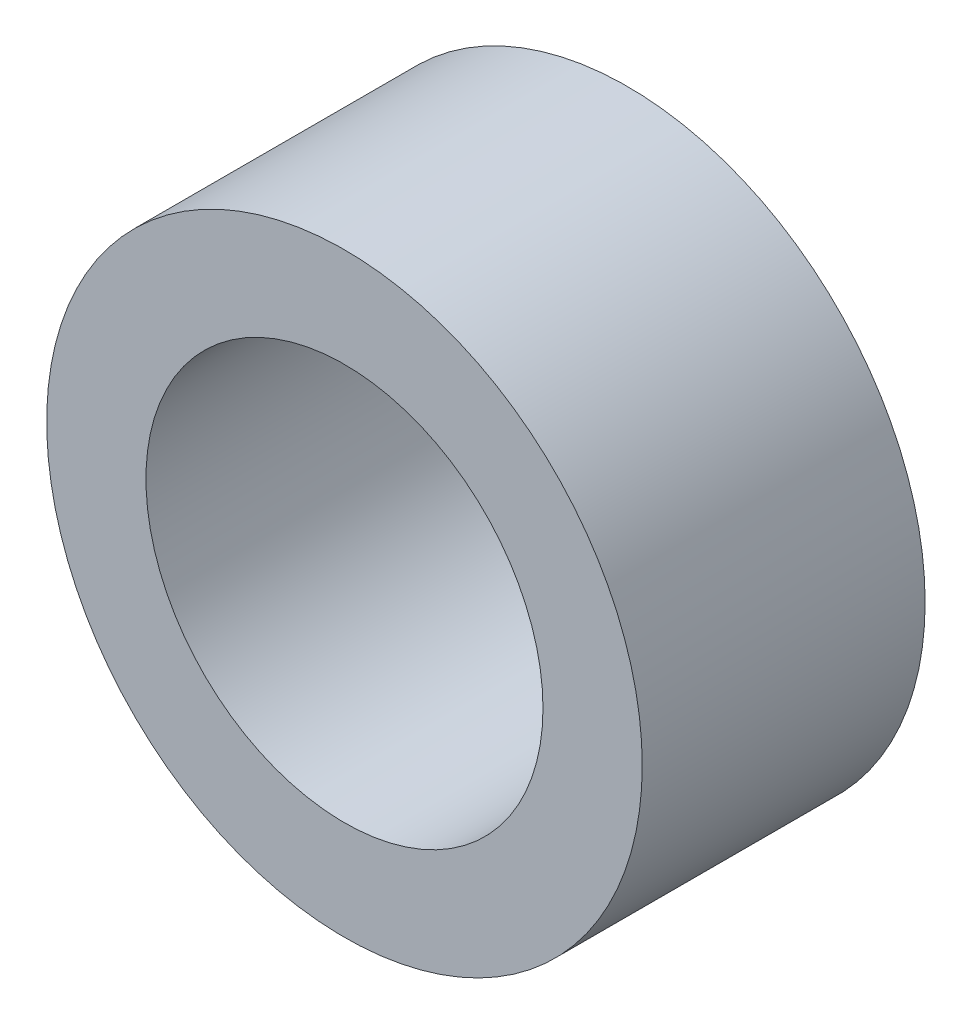
ISO-10303-21;
HEADER;
FILE_DESCRIPTION(('STEP AP214'),'2;1');
FILE_NAME('part.step','',(''),(''),'','','');
FILE_SCHEMA(('AUTOMOTIVE_DESIGN { 1 0 10303 214 1 1 1 1 }'));
ENDSEC;
DATA;
#1=APPLICATION_CONTEXT('core data for automotive mechanical design processes');
#2=APPLICATION_PROTOCOL_DEFINITION('international standard','automotive_design',2000,#1);
#3=PRODUCT_CONTEXT('',#1,'mechanical');
#4=PRODUCT('Part','Part','',(#3));
#5=PRODUCT_RELATED_PRODUCT_CATEGORY('part','',(#4));
#6=PRODUCT_DEFINITION_FORMATION('','',#4);
#7=PRODUCT_DEFINITION_CONTEXT('part definition',#1,'design');
#8=PRODUCT_DEFINITION('design','',#6,#7);
#9=PRODUCT_DEFINITION_SHAPE('','',#8);
#10=(LENGTH_UNIT() NAMED_UNIT(*) SI_UNIT(.MILLI.,.METRE.));
#11=(NAMED_UNIT(*) PLANE_ANGLE_UNIT() SI_UNIT($,.RADIAN.));
#12=(NAMED_UNIT(*) SI_UNIT($,.STERADIAN.) SOLID_ANGLE_UNIT());
#13=UNCERTAINTY_MEASURE_WITH_UNIT(LENGTH_MEASURE(1.E-05),#10,'distance_accuracy_value','');
#14=(GEOMETRIC_REPRESENTATION_CONTEXT(3) GLOBAL_UNCERTAINTY_ASSIGNED_CONTEXT((#13)) GLOBAL_UNIT_ASSIGNED_CONTEXT((#10,
#11,#12)) REPRESENTATION_CONTEXT('',''));
#15=CARTESIAN_POINT('',(0.,0.,0.));
#16=DIRECTION('',(0.,0.,1.));
#17=DIRECTION('',(1.,0.,0.));
#18=AXIS2_PLACEMENT_3D('',#15,#16,#17);
#19=CARTESIAN_POINT('',(0.,0.,0.));
#20=DIRECTION('',(0.,0.,1.));
#21=DIRECTION('',(1.,0.,0.));
#22=AXIS2_PLACEMENT_3D('',#19,#20,#21);
#23=CYLINDRICAL_SURFACE('',#22,2.);
#24=CARTESIAN_POINT('',(0.,0.,0.));
#25=DIRECTION('',(0.,0.,1.));
#26=DIRECTION('',(1.,0.,0.));
#27=AXIS2_PLACEMENT_3D('',#24,#25,#26);
#28=CIRCLE('',#27,2.);
#29=CARTESIAN_POINT('',(2.,0.,0.));
#30=VERTEX_POINT('',#29);
#31=EDGE_CURVE('E17',#30,#30,#28,.F.);
#32=ORIENTED_EDGE('',*,*,#31,.T.);
#33=EDGE_LOOP('',(#32));
#34=FACE_BOUND('',#33,.T.);
#35=CARTESIAN_POINT('',(0.,0.,2.85));
#36=DIRECTION('',(0.,0.,1.));
#37=DIRECTION('',(1.,0.,0.));
#38=AXIS2_PLACEMENT_3D('',#35,#36,#37);
#39=CIRCLE('',#38,2.);
#40=CARTESIAN_POINT('',(2.,0.,2.85));
#41=VERTEX_POINT('',#40);
#42=EDGE_CURVE('E26',#41,#41,#39,.F.);
#43=ORIENTED_EDGE('',*,*,#42,.F.);
#44=EDGE_LOOP('',(#43));
#45=FACE_BOUND('',#44,.T.);
#46=ADVANCED_FACE('F14',(#34,#45),#23,.F.);
#47=CARTESIAN_POINT('',(0.,0.,0.));
#48=DIRECTION('',(0.,0.,1.));
#49=DIRECTION('',(1.,0.,0.));
#50=AXIS2_PLACEMENT_3D('',#47,#48,#49);
#51=PLANE('',#50);
#52=CARTESIAN_POINT('',(0.,0.,0.));
#53=DIRECTION('',(0.,0.,1.));
#54=DIRECTION('',(1.,0.,0.));
#55=AXIS2_PLACEMENT_3D('',#52,#53,#54);
#56=CIRCLE('',#55,3.);
#57=CARTESIAN_POINT('',(3.,0.,0.));
#58=VERTEX_POINT('',#57);
#59=EDGE_CURVE('E21',#58,#58,#56,.T.);
#60=ORIENTED_EDGE('',*,*,#59,.F.);
#61=EDGE_LOOP('',(#60));
#62=FACE_BOUND('',#61,.T.);
#63=ORIENTED_EDGE('',*,*,#31,.F.);
#64=EDGE_LOOP('',(#63));
#65=FACE_BOUND('',#64,.T.);
#66=ADVANCED_FACE('F36',(#62,#65),#51,.F.);
#67=CARTESIAN_POINT('',(0.,0.,2.85));
#68=DIRECTION('',(0.,0.,1.));
#69=DIRECTION('',(1.,0.,0.));
#70=AXIS2_PLACEMENT_3D('',#67,#68,#69);
#71=PLANE('',#70);
#72=CARTESIAN_POINT('',(0.,0.,2.85));
#73=DIRECTION('',(0.,0.,1.));
#74=DIRECTION('',(1.,0.,0.));
#75=AXIS2_PLACEMENT_3D('',#72,#73,#74);
#76=CIRCLE('',#75,3.);
#77=CARTESIAN_POINT('',(3.,0.,2.85));
#78=VERTEX_POINT('',#77);
#79=EDGE_CURVE('E10',#78,#78,#76,.F.);
#80=ORIENTED_EDGE('',*,*,#79,.F.);
#81=EDGE_LOOP('',(#80));
#82=FACE_BOUND('',#81,.T.);
#83=ORIENTED_EDGE('',*,*,#42,.T.);
#84=EDGE_LOOP('',(#83));
#85=FACE_BOUND('',#84,.T.);
#86=ADVANCED_FACE('F38',(#82,#85),#71,.T.);
#87=CARTESIAN_POINT('',(0.,0.,0.));
#88=DIRECTION('',(0.,0.,1.));
#89=DIRECTION('',(1.,0.,0.));
#90=AXIS2_PLACEMENT_3D('',#87,#88,#89);
#91=CYLINDRICAL_SURFACE('',#90,3.);
#92=ORIENTED_EDGE('',*,*,#79,.T.);
#93=EDGE_LOOP('',(#92));
#94=FACE_BOUND('',#93,.T.);
#95=ORIENTED_EDGE('',*,*,#59,.T.);
#96=EDGE_LOOP('',(#95));
#97=FACE_BOUND('',#96,.T.);
#98=ADVANCED_FACE('F45',(#94,#97),#91,.T.);
#99=CLOSED_SHELL('',(#46,#66,#86,#98));
#100=MANIFOLD_SOLID_BREP('B1',#99);
#101=ADVANCED_BREP_SHAPE_REPRESENTATION('',(#18,#100),#14);
#102=SHAPE_DEFINITION_REPRESENTATION(#9,#101);
ENDSEC;
END-ISO-10303-21;
